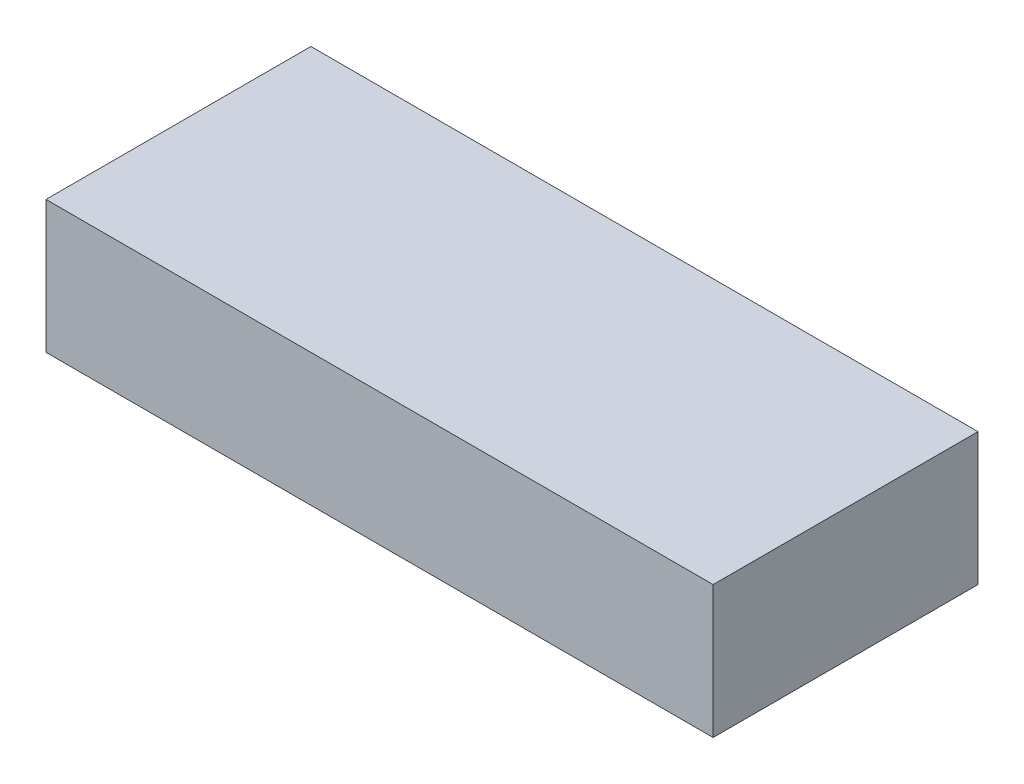
ISO-10303-21;
HEADER;
FILE_DESCRIPTION(('STEP AP214'),'2;1');
FILE_NAME('part.step','',(''),(''),'','','');
FILE_SCHEMA(('AUTOMOTIVE_DESIGN { 1 0 10303 214 1 1 1 1 }'));
ENDSEC;
DATA;
#1=APPLICATION_CONTEXT('core data for automotive mechanical design processes');
#2=APPLICATION_PROTOCOL_DEFINITION('international standard','automotive_design',2000,#1);
#3=PRODUCT_CONTEXT('',#1,'mechanical');
#4=PRODUCT('Part','Part','',(#3));
#5=PRODUCT_RELATED_PRODUCT_CATEGORY('part','',(#4));
#6=PRODUCT_DEFINITION_FORMATION('','',#4);
#7=PRODUCT_DEFINITION_CONTEXT('part definition',#1,'design');
#8=PRODUCT_DEFINITION('design','',#6,#7);
#9=PRODUCT_DEFINITION_SHAPE('','',#8);
#10=(LENGTH_UNIT() NAMED_UNIT(*) SI_UNIT(.MILLI.,.METRE.));
#11=(NAMED_UNIT(*) PLANE_ANGLE_UNIT() SI_UNIT($,.RADIAN.));
#12=(NAMED_UNIT(*) SI_UNIT($,.STERADIAN.) SOLID_ANGLE_UNIT());
#13=UNCERTAINTY_MEASURE_WITH_UNIT(LENGTH_MEASURE(1.E-05),#10,'distance_accuracy_value','');
#14=(GEOMETRIC_REPRESENTATION_CONTEXT(3) GLOBAL_UNCERTAINTY_ASSIGNED_CONTEXT((#13)) GLOBAL_UNIT_ASSIGNED_CONTEXT((#10,
#11,#12)) REPRESENTATION_CONTEXT('',''));
#15=CARTESIAN_POINT('',(0.,0.,0.));
#16=DIRECTION('',(0.,0.,1.));
#17=DIRECTION('',(1.,0.,0.));
#18=AXIS2_PLACEMENT_3D('',#15,#16,#17);
#19=CARTESIAN_POINT('',(215.9,85.725,85.725));
#20=DIRECTION('',(-1.,0.,0.));
#21=DIRECTION('',(0.,0.,1.));
#22=AXIS2_PLACEMENT_3D('',#19,#20,#21);
#23=PLANE('',#22);
#24=DIRECTION('',(0.,0.,-1.));
#25=VECTOR('',#24,1.);
#26=CARTESIAN_POINT('',(215.9,0.,85.725));
#27=LINE('',#26,#25);
#28=CARTESIAN_POINT('',(215.9,0.,85.725));
#29=VERTEX_POINT('',#28);
#30=CARTESIAN_POINT('',(215.9,0.,-85.725));
#31=VERTEX_POINT('',#30);
#32=EDGE_CURVE('E179',#29,#31,#27,.T.);
#33=ORIENTED_EDGE('',*,*,#32,.T.);
#34=DIRECTION('',(0.,-1.,0.));
#35=VECTOR('',#34,1.);
#36=CARTESIAN_POINT('',(215.9,85.725,-85.725));
#37=LINE('',#36,#35);
#38=CARTESIAN_POINT('',(215.9,85.725,-85.725));
#39=VERTEX_POINT('',#38);
#40=EDGE_CURVE('E211',#39,#31,#37,.T.);
#41=ORIENTED_EDGE('',*,*,#40,.F.);
#42=DIRECTION('',(0.,0.,-1.));
#43=VECTOR('',#42,1.);
#44=CARTESIAN_POINT('',(215.9,85.725,85.725));
#45=LINE('',#44,#43);
#46=CARTESIAN_POINT('',(215.9,85.725,85.725));
#47=VERTEX_POINT('',#46);
#48=EDGE_CURVE('E188',#47,#39,#45,.T.);
#49=ORIENTED_EDGE('',*,*,#48,.F.);
#50=DIRECTION('',(0.,-1.,0.));
#51=VECTOR('',#50,1.);
#52=CARTESIAN_POINT('',(215.9,85.725,85.725));
#53=LINE('',#52,#51);
#54=EDGE_CURVE('E197',#47,#29,#53,.T.);
#55=ORIENTED_EDGE('',*,*,#54,.T.);
#56=EDGE_LOOP('',(#33,#41,#49,#55));
#57=FACE_BOUND('',#56,.T.);
#58=ADVANCED_FACE('F41',(#57),#23,.F.);
#59=CARTESIAN_POINT('',(-215.9,85.725,-85.725));
#60=DIRECTION('',(0.,0.,1.));
#61=DIRECTION('',(1.,0.,0.));
#62=AXIS2_PLACEMENT_3D('',#59,#60,#61);
#63=PLANE('',#62);
#64=DIRECTION('',(-1.,0.,0.));
#65=VECTOR('',#64,1.);
#66=CARTESIAN_POINT('',(-215.9,0.,-85.725));
#67=LINE('',#66,#65);
#68=CARTESIAN_POINT('',(-215.9,0.,-85.725));
#69=VERTEX_POINT('',#68);
#70=EDGE_CURVE('E182',#31,#69,#67,.T.);
#71=ORIENTED_EDGE('',*,*,#70,.T.);
#72=DIRECTION('',(0.,-1.,0.));
#73=VECTOR('',#72,1.);
#74=CARTESIAN_POINT('',(-215.9,85.725,-85.725));
#75=LINE('',#74,#73);
#76=CARTESIAN_POINT('',(-215.9,85.725,-85.725));
#77=VERTEX_POINT('',#76);
#78=EDGE_CURVE('E208',#77,#69,#75,.T.);
#79=ORIENTED_EDGE('',*,*,#78,.F.);
#80=DIRECTION('',(-1.,0.,0.));
#81=VECTOR('',#80,1.);
#82=CARTESIAN_POINT('',(-215.9,85.725,-85.725));
#83=LINE('',#82,#81);
#84=EDGE_CURVE('E191',#39,#77,#83,.T.);
#85=ORIENTED_EDGE('',*,*,#84,.F.);
#86=ORIENTED_EDGE('',*,*,#40,.T.);
#87=EDGE_LOOP('',(#71,#79,#85,#86));
#88=FACE_BOUND('',#87,.T.);
#89=ADVANCED_FACE('F346',(#88),#63,.F.);
#90=CARTESIAN_POINT('',(-215.9,85.725,85.725));
#91=DIRECTION('',(1.,0.,0.));
#92=DIRECTION('',(0.,0.,-1.));
#93=AXIS2_PLACEMENT_3D('',#90,#91,#92);
#94=PLANE('',#93);
#95=DIRECTION('',(0.,0.,1.));
#96=VECTOR('',#95,1.);
#97=CARTESIAN_POINT('',(-215.9,0.,85.725));
#98=LINE('',#97,#96);
#99=CARTESIAN_POINT('',(-215.9,0.,85.725));
#100=VERTEX_POINT('',#99);
#101=EDGE_CURVE('E200',#69,#100,#98,.T.);
#102=ORIENTED_EDGE('',*,*,#101,.T.);
#103=DIRECTION('',(0.,-1.,0.));
#104=VECTOR('',#103,1.);
#105=CARTESIAN_POINT('',(-215.9,85.725,85.725));
#106=LINE('',#105,#104);
#107=CARTESIAN_POINT('',(-215.9,85.725,85.725));
#108=VERTEX_POINT('',#107);
#109=EDGE_CURVE('E205',#108,#100,#106,.T.);
#110=ORIENTED_EDGE('',*,*,#109,.F.);
#111=DIRECTION('',(0.,0.,1.));
#112=VECTOR('',#111,1.);
#113=CARTESIAN_POINT('',(-215.9,85.725,85.725));
#114=LINE('',#113,#112);
#115=EDGE_CURVE('E194',#77,#108,#114,.T.);
#116=ORIENTED_EDGE('',*,*,#115,.F.);
#117=ORIENTED_EDGE('',*,*,#78,.T.);
#118=EDGE_LOOP('',(#102,#110,#116,#117));
#119=FACE_BOUND('',#118,.T.);
#120=ADVANCED_FACE('F352',(#119),#94,.F.);
#121=CARTESIAN_POINT('',(-215.9,85.725,85.725));
#122=DIRECTION('',(0.,0.,-1.));
#123=DIRECTION('',(-1.,0.,0.));
#124=AXIS2_PLACEMENT_3D('',#121,#122,#123);
#125=PLANE('',#124);
#126=DIRECTION('',(1.,0.,0.));
#127=VECTOR('',#126,1.);
#128=CARTESIAN_POINT('',(-215.9,0.,85.725));
#129=LINE('',#128,#127);
#130=EDGE_CURVE('E192',#100,#29,#129,.T.);
#131=ORIENTED_EDGE('',*,*,#130,.T.);
#132=ORIENTED_EDGE('',*,*,#54,.F.);
#133=DIRECTION('',(1.,0.,0.));
#134=VECTOR('',#133,1.);
#135=CARTESIAN_POINT('',(-215.9,85.725,85.725));
#136=LINE('',#135,#134);
#137=EDGE_CURVE('E196',#108,#47,#136,.T.);
#138=ORIENTED_EDGE('',*,*,#137,.F.);
#139=ORIENTED_EDGE('',*,*,#109,.T.);
#140=EDGE_LOOP('',(#131,#132,#138,#139));
#141=FACE_BOUND('',#140,.T.);
#142=ADVANCED_FACE('F499',(#141),#125,.F.);
#143=CARTESIAN_POINT('',(0.,85.725,0.));
#144=DIRECTION('',(0.,-1.,0.));
#145=DIRECTION('',(0.,0.,-1.));
#146=AXIS2_PLACEMENT_3D('',#143,#144,#145);
#147=PLANE('',#146);
#148=ORIENTED_EDGE('',*,*,#48,.T.);
#149=ORIENTED_EDGE('',*,*,#84,.T.);
#150=ORIENTED_EDGE('',*,*,#115,.T.);
#151=ORIENTED_EDGE('',*,*,#137,.T.);
#152=EDGE_LOOP('',(#148,#149,#150,#151));
#153=FACE_BOUND('',#152,.T.);
#154=ADVANCED_FACE('F464',(#153),#147,.F.);
#155=CARTESIAN_POINT('',(0.,0.,0.));
#156=DIRECTION('',(0.,-1.,0.));
#157=DIRECTION('',(0.,0.,-1.));
#158=AXIS2_PLACEMENT_3D('',#155,#156,#157);
#159=PLANE('',#158);
#160=DIRECTION('',(0.,0.,-1.));
#161=VECTOR('',#160,1.);
#162=CARTESIAN_POINT('',(202.950394914719,0.,-48.6314169137195));
#163=LINE('',#162,#161);
#164=CARTESIAN_POINT('',(202.950394914719,0.,48.6314169137195));
#165=VERTEX_POINT('',#164);
#166=CARTESIAN_POINT('',(202.950394914719,0.,-48.6314169137195));
#167=VERTEX_POINT('',#166);
#168=EDGE_CURVE('E226',#165,#167,#163,.T.);
#169=ORIENTED_EDGE('',*,*,#168,.T.);
#170=CARTESIAN_POINT('',(178.806416913719,0.,-48.6314169137195));
#171=DIRECTION('',(0.,-1.,0.));
#172=DIRECTION('',(0.,0.,-1.));
#173=AXIS2_PLACEMENT_3D('',#170,#171,#172);
#174=CIRCLE('',#173,24.143978001);
#175=CARTESIAN_POINT('',(178.806416913719,0.,-72.7753949147195));
#176=VERTEX_POINT('',#175);
#177=EDGE_CURVE('E228',#167,#176,#174,.F.);
#178=ORIENTED_EDGE('',*,*,#177,.T.);
#179=DIRECTION('',(-1.,0.,0.));
#180=VECTOR('',#179,1.);
#181=CARTESIAN_POINT('',(-178.806416913719,0.,-72.7753949147195));
#182=LINE('',#181,#180);
#183=CARTESIAN_POINT('',(-178.806416913719,0.,-72.7753949147195));
#184=VERTEX_POINT('',#183);
#185=EDGE_CURVE('E218',#176,#184,#182,.T.);
#186=ORIENTED_EDGE('',*,*,#185,.T.);
#187=CARTESIAN_POINT('',(-178.806416913719,0.,-48.6314169137195));
#188=DIRECTION('',(0.,-1.,0.));
#189=DIRECTION('',(0.,0.,-1.));
#190=AXIS2_PLACEMENT_3D('',#187,#188,#189);
#191=CIRCLE('',#190,24.143978001);
#192=CARTESIAN_POINT('',(-202.950394914719,0.,-48.6314169137195));
#193=VERTEX_POINT('',#192);
#194=EDGE_CURVE('E214',#184,#193,#191,.F.);
#195=ORIENTED_EDGE('',*,*,#194,.T.);
#196=DIRECTION('',(0.,0.,1.));
#197=VECTOR('',#196,1.);
#198=CARTESIAN_POINT('',(-202.950394914719,0.,48.6314169137195));
#199=LINE('',#198,#197);
#200=CARTESIAN_POINT('',(-202.950394914719,0.,48.6314169137195));
#201=VERTEX_POINT('',#200);
#202=EDGE_CURVE('E216',#193,#201,#199,.T.);
#203=ORIENTED_EDGE('',*,*,#202,.T.);
#204=CARTESIAN_POINT('',(-178.806416913719,0.,48.6314169137195));
#205=DIRECTION('',(0.,-1.,0.));
#206=DIRECTION('',(0.,0.,-1.));
#207=AXIS2_PLACEMENT_3D('',#204,#205,#206);
#208=CIRCLE('',#207,24.143978001);
#209=CARTESIAN_POINT('',(-178.806416913719,0.,72.7753949147195));
#210=VERTEX_POINT('',#209);
#211=EDGE_CURVE('E220',#201,#210,#208,.F.);
#212=ORIENTED_EDGE('',*,*,#211,.T.);
#213=DIRECTION('',(1.,0.,0.));
#214=VECTOR('',#213,1.);
#215=CARTESIAN_POINT('',(178.806416913719,0.,72.7753949147195));
#216=LINE('',#215,#214);
#217=CARTESIAN_POINT('',(178.806416913719,0.,72.7753949147195));
#218=VERTEX_POINT('',#217);
#219=EDGE_CURVE('E222',#210,#218,#216,.T.);
#220=ORIENTED_EDGE('',*,*,#219,.T.);
#221=CARTESIAN_POINT('',(178.806416913719,0.,48.6314169137195));
#222=DIRECTION('',(0.,-1.,0.));
#223=DIRECTION('',(0.,0.,-1.));
#224=AXIS2_PLACEMENT_3D('',#221,#222,#223);
#225=CIRCLE('',#224,24.143978001);
#226=EDGE_CURVE('E224',#218,#165,#225,.F.);
#227=ORIENTED_EDGE('',*,*,#226,.T.);
#228=EDGE_LOOP('',(#169,#178,#186,#195,#203,#212,#220,#227));
#229=FACE_BOUND('',#228,.T.);
#230=ORIENTED_EDGE('',*,*,#32,.F.);
#231=ORIENTED_EDGE('',*,*,#130,.F.);
#232=ORIENTED_EDGE('',*,*,#101,.F.);
#233=ORIENTED_EDGE('',*,*,#70,.F.);
#234=EDGE_LOOP('',(#230,#231,#232,#233));
#235=FACE_BOUND('',#234,.T.);
#236=ADVANCED_FACE('F469',(#229,#235),#159,.T.);
#237=CARTESIAN_POINT('',(178.806416913719,515.309709215543,72.1403949147195));
#238=DIRECTION('',(0.,0.,1.));
#239=DIRECTION('',(1.,0.,0.));
#240=AXIS2_PLACEMENT_3D('',#237,#238,#239);
#241=PLANE('',#240);
#242=DIRECTION('',(0.,-1.,0.));
#243=VECTOR('',#242,1.);
#244=CARTESIAN_POINT('',(178.806416913719,515.309709215543,72.1403949147195));
#245=LINE('',#244,#243);
#246=CARTESIAN_POINT('',(178.806416913719,73.025,72.1403949147195));
#247=VERTEX_POINT('',#246);
#248=CARTESIAN_POINT('',(178.806416913719,0.634999999999941,72.1403949147195));
#249=VERTEX_POINT('',#248);
#250=EDGE_CURVE('E164',#247,#249,#245,.T.);
#251=ORIENTED_EDGE('',*,*,#250,.T.);
#252=DIRECTION('',(-1.,0.,0.));
#253=VECTOR('',#252,1.);
#254=CARTESIAN_POINT('',(-178.806416913719,0.634999999999941,72.1403949147195));
#255=LINE('',#254,#253);
#256=CARTESIAN_POINT('',(-178.806416913719,0.634999999999941,72.1403949147195));
#257=VERTEX_POINT('',#256);
#258=EDGE_CURVE('E238',#249,#257,#255,.T.);
#259=ORIENTED_EDGE('',*,*,#258,.T.);
#260=DIRECTION('',(0.,-1.,0.));
#261=VECTOR('',#260,1.);
#262=CARTESIAN_POINT('',(-178.806416913719,515.309709215543,72.1403949147195));
#263=LINE('',#262,#261);
#264=CARTESIAN_POINT('',(-178.806416913719,73.025,72.1403949147195));
#265=VERTEX_POINT('',#264);
#266=EDGE_CURVE('E173',#265,#257,#263,.T.);
#267=ORIENTED_EDGE('',*,*,#266,.F.);
#268=DIRECTION('',(1.,0.,0.));
#269=VECTOR('',#268,1.);
#270=CARTESIAN_POINT('',(178.806416913719,73.025,72.1403949147195));
#271=LINE('',#270,#269);
#272=EDGE_CURVE('E177',#265,#247,#271,.T.);
#273=ORIENTED_EDGE('',*,*,#272,.T.);
#274=EDGE_LOOP('',(#251,#259,#267,#273));
#275=FACE_BOUND('',#274,.T.);
#276=ADVANCED_FACE('F324',(#275),#241,.F.);
#277=CARTESIAN_POINT('',(178.806416913719,515.309709215543,48.6314169137195));
#278=DIRECTION('',(0.,-1.,0.));
#279=DIRECTION('',(0.,0.,-1.));
#280=AXIS2_PLACEMENT_3D('',#277,#278,#279);
#281=CYLINDRICAL_SURFACE('',#280,23.508978001);
#282=DIRECTION('',(0.,-1.,0.));
#283=VECTOR('',#282,1.);
#284=CARTESIAN_POINT('',(202.315394914719,515.309709215543,48.6314169137195));
#285=LINE('',#284,#283);
#286=CARTESIAN_POINT('',(202.315394914719,73.025,48.6314169137195));
#287=VERTEX_POINT('',#286);
#288=CARTESIAN_POINT('',(202.315394914719,0.634999999999941,48.6314169137195));
#289=VERTEX_POINT('',#288);
#290=EDGE_CURVE('E311',#287,#289,#285,.T.);
#291=ORIENTED_EDGE('',*,*,#290,.T.);
#292=CARTESIAN_POINT('',(178.806416913719,0.634999999999941,48.6314169137195));
#293=DIRECTION('',(0.,-1.,0.));
#294=DIRECTION('',(0.,0.,-1.));
#295=AXIS2_PLACEMENT_3D('',#292,#293,#294);
#296=CIRCLE('',#295,23.508978001);
#297=EDGE_CURVE('E236',#289,#249,#296,.T.);
#298=ORIENTED_EDGE('',*,*,#297,.T.);
#299=ORIENTED_EDGE('',*,*,#250,.F.);
#300=CARTESIAN_POINT('',(178.806416913719,73.025,48.6314169137195));
#301=DIRECTION('',(0.,-1.,0.));
#302=DIRECTION('',(0.,0.,-1.));
#303=AXIS2_PLACEMENT_3D('',#300,#301,#302);
#304=CIRCLE('',#303,23.508978001);
#305=EDGE_CURVE('E184',#287,#247,#304,.T.);
#306=ORIENTED_EDGE('',*,*,#305,.F.);
#307=EDGE_LOOP('',(#291,#298,#299,#306));
#308=FACE_BOUND('',#307,.T.);
#309=ADVANCED_FACE('F314',(#308),#281,.F.);
#310=CARTESIAN_POINT('',(202.315394914719,515.309709215543,-48.6314169137195));
#311=DIRECTION('',(1.,0.,0.));
#312=DIRECTION('',(0.,0.,-1.));
#313=AXIS2_PLACEMENT_3D('',#310,#311,#312);
#314=PLANE('',#313);
#315=DIRECTION('',(0.,-1.,0.));
#316=VECTOR('',#315,1.);
#317=CARTESIAN_POINT('',(202.315394914719,515.309709215543,-48.6314169137195));
#318=LINE('',#317,#316);
#319=CARTESIAN_POINT('',(202.315394914719,73.025,-48.6314169137195));
#320=VERTEX_POINT('',#319);
#321=CARTESIAN_POINT('',(202.315394914719,0.634999999999941,-48.6314169137195));
#322=VERTEX_POINT('',#321);
#323=EDGE_CURVE('E296',#320,#322,#318,.T.);
#324=ORIENTED_EDGE('',*,*,#323,.T.);
#325=DIRECTION('',(0.,0.,1.));
#326=VECTOR('',#325,1.);
#327=CARTESIAN_POINT('',(202.315394914719,0.634999999999941,48.6314169137195));
#328=LINE('',#327,#326);
#329=EDGE_CURVE('E234',#322,#289,#328,.T.);
#330=ORIENTED_EDGE('',*,*,#329,.T.);
#331=ORIENTED_EDGE('',*,*,#290,.F.);
#332=DIRECTION('',(0.,0.,-1.));
#333=VECTOR('',#332,1.);
#334=CARTESIAN_POINT('',(202.315394914719,73.025,-48.6314169137195));
#335=LINE('',#334,#333);
#336=EDGE_CURVE('E336',#287,#320,#335,.T.);
#337=ORIENTED_EDGE('',*,*,#336,.T.);
#338=EDGE_LOOP('',(#324,#330,#331,#337));
#339=FACE_BOUND('',#338,.T.);
#340=ADVANCED_FACE('F310',(#339),#314,.F.);
#341=CARTESIAN_POINT('',(178.806416913719,515.309709215543,-48.6314169137195));
#342=DIRECTION('',(0.,-1.,0.));
#343=DIRECTION('',(0.,0.,-1.));
#344=AXIS2_PLACEMENT_3D('',#341,#342,#343);
#345=CYLINDRICAL_SURFACE('',#344,23.508978001);
#346=DIRECTION('',(0.,-1.,0.));
#347=VECTOR('',#346,1.);
#348=CARTESIAN_POINT('',(178.806416913719,515.309709215543,-72.1403949147196));
#349=LINE('',#348,#347);
#350=CARTESIAN_POINT('',(178.806416913719,73.025,-72.1403949147195));
#351=VERTEX_POINT('',#350);
#352=CARTESIAN_POINT('',(178.806416913719,0.634999999999941,-72.1403949147196));
#353=VERTEX_POINT('',#352);
#354=EDGE_CURVE('E286',#351,#353,#349,.T.);
#355=ORIENTED_EDGE('',*,*,#354,.T.);
#356=CARTESIAN_POINT('',(178.806416913719,0.634999999999941,-48.6314169137195));
#357=DIRECTION('',(0.,-1.,0.));
#358=DIRECTION('',(0.,0.,-1.));
#359=AXIS2_PLACEMENT_3D('',#356,#357,#358);
#360=CIRCLE('',#359,23.508978001);
#361=EDGE_CURVE('E231',#353,#322,#360,.T.);
#362=ORIENTED_EDGE('',*,*,#361,.T.);
#363=ORIENTED_EDGE('',*,*,#323,.F.);
#364=CARTESIAN_POINT('',(178.806416913719,73.025,-48.6314169137195));
#365=DIRECTION('',(0.,-1.,0.));
#366=DIRECTION('',(0.,0.,-1.));
#367=AXIS2_PLACEMENT_3D('',#364,#365,#366);
#368=CIRCLE('',#367,23.508978001);
#369=EDGE_CURVE('E294',#351,#320,#368,.T.);
#370=ORIENTED_EDGE('',*,*,#369,.F.);
#371=EDGE_LOOP('',(#355,#362,#363,#370));
#372=FACE_BOUND('',#371,.T.);
#373=ADVANCED_FACE('F290',(#372),#345,.F.);
#374=CARTESIAN_POINT('',(-178.806416913719,515.309709215543,-72.1403949147195));
#375=DIRECTION('',(0.,0.,-1.));
#376=DIRECTION('',(-1.,0.,0.));
#377=AXIS2_PLACEMENT_3D('',#374,#375,#376);
#378=PLANE('',#377);
#379=DIRECTION('',(0.,-1.,0.));
#380=VECTOR('',#379,1.);
#381=CARTESIAN_POINT('',(-178.806416913719,515.309709215543,-72.1403949147195));
#382=LINE('',#381,#380);
#383=CARTESIAN_POINT('',(-178.806416913719,73.025,-72.1403949147196));
#384=VERTEX_POINT('',#383);
#385=CARTESIAN_POINT('',(-178.806416913719,0.634999999999941,-72.1403949147195));
#386=VERTEX_POINT('',#385);
#387=EDGE_CURVE('E287',#384,#386,#382,.T.);
#388=ORIENTED_EDGE('',*,*,#387,.T.);
#389=DIRECTION('',(1.,0.,0.));
#390=VECTOR('',#389,1.);
#391=CARTESIAN_POINT('',(178.806416913719,0.634999999999941,-72.1403949147195));
#392=LINE('',#391,#390);
#393=EDGE_CURVE('E241',#386,#353,#392,.T.);
#394=ORIENTED_EDGE('',*,*,#393,.T.);
#395=ORIENTED_EDGE('',*,*,#354,.F.);
#396=DIRECTION('',(-1.,0.,0.));
#397=VECTOR('',#396,1.);
#398=CARTESIAN_POINT('',(-178.806416913719,73.025,-72.1403949147195));
#399=LINE('',#398,#397);
#400=EDGE_CURVE('E331',#351,#384,#399,.T.);
#401=ORIENTED_EDGE('',*,*,#400,.T.);
#402=EDGE_LOOP('',(#388,#394,#395,#401));
#403=FACE_BOUND('',#402,.T.);
#404=ADVANCED_FACE('F285',(#403),#378,.F.);
#405=CARTESIAN_POINT('',(-178.806416913719,515.309709215543,-48.6314169137195));
#406=DIRECTION('',(0.,-1.,0.));
#407=DIRECTION('',(0.,0.,-1.));
#408=AXIS2_PLACEMENT_3D('',#405,#406,#407);
#409=CYLINDRICAL_SURFACE('',#408,23.508978001);
#410=DIRECTION('',(0.,-1.,0.));
#411=VECTOR('',#410,1.);
#412=CARTESIAN_POINT('',(-202.315394914719,515.309709215543,-48.6314169137195));
#413=LINE('',#412,#411);
#414=CARTESIAN_POINT('',(-202.315394914719,73.025,-48.6314169137195));
#415=VERTEX_POINT('',#414);
#416=CARTESIAN_POINT('',(-202.315394914719,0.634999999999941,-48.6314169137195));
#417=VERTEX_POINT('',#416);
#418=EDGE_CURVE('E159',#415,#417,#413,.T.);
#419=ORIENTED_EDGE('',*,*,#418,.T.);
#420=CARTESIAN_POINT('',(-178.806416913719,0.634999999999941,-48.6314169137195));
#421=DIRECTION('',(0.,-1.,0.));
#422=DIRECTION('',(0.,0.,-1.));
#423=AXIS2_PLACEMENT_3D('',#420,#421,#422);
#424=CIRCLE('',#423,23.508978001);
#425=EDGE_CURVE('E12',#417,#386,#424,.T.);
#426=ORIENTED_EDGE('',*,*,#425,.T.);
#427=ORIENTED_EDGE('',*,*,#387,.F.);
#428=CARTESIAN_POINT('',(-178.806416913719,73.025,-48.6314169137195));
#429=DIRECTION('',(0.,-1.,0.));
#430=DIRECTION('',(0.,0.,-1.));
#431=AXIS2_PLACEMENT_3D('',#428,#429,#430);
#432=CIRCLE('',#431,23.508978001);
#433=EDGE_CURVE('E163',#415,#384,#432,.T.);
#434=ORIENTED_EDGE('',*,*,#433,.F.);
#435=EDGE_LOOP('',(#419,#426,#427,#434));
#436=FACE_BOUND('',#435,.T.);
#437=ADVANCED_FACE('F330',(#436),#409,.F.);
#438=CARTESIAN_POINT('',(-202.315394914719,515.309709215543,48.6314169137195));
#439=DIRECTION('',(-1.,0.,0.));
#440=DIRECTION('',(0.,0.,1.));
#441=AXIS2_PLACEMENT_3D('',#438,#439,#440);
#442=PLANE('',#441);
#443=DIRECTION('',(0.,-1.,0.));
#444=VECTOR('',#443,1.);
#445=CARTESIAN_POINT('',(-202.315394914719,515.309709215543,48.6314169137195));
#446=LINE('',#445,#444);
#447=CARTESIAN_POINT('',(-202.315394914719,73.025,48.6314169137195));
#448=VERTEX_POINT('',#447);
#449=CARTESIAN_POINT('',(-202.315394914719,0.634999999999941,48.6314169137195));
#450=VERTEX_POINT('',#449);
#451=EDGE_CURVE('E157',#448,#450,#446,.T.);
#452=ORIENTED_EDGE('',*,*,#451,.T.);
#453=DIRECTION('',(0.,0.,-1.));
#454=VECTOR('',#453,1.);
#455=CARTESIAN_POINT('',(-202.315394914719,0.634999999999941,-48.6314169137195));
#456=LINE('',#455,#454);
#457=EDGE_CURVE('E50',#450,#417,#456,.T.);
#458=ORIENTED_EDGE('',*,*,#457,.T.);
#459=ORIENTED_EDGE('',*,*,#418,.F.);
#460=DIRECTION('',(0.,0.,1.));
#461=VECTOR('',#460,1.);
#462=CARTESIAN_POINT('',(-202.315394914719,73.025,48.6314169137195));
#463=LINE('',#462,#461);
#464=EDGE_CURVE('E154',#415,#448,#463,.T.);
#465=ORIENTED_EDGE('',*,*,#464,.T.);
#466=EDGE_LOOP('',(#452,#458,#459,#465));
#467=FACE_BOUND('',#466,.T.);
#468=ADVANCED_FACE('F156',(#467),#442,.F.);
#469=CARTESIAN_POINT('',(-178.806416913719,515.309709215543,48.6314169137195));
#470=DIRECTION('',(0.,-1.,0.));
#471=DIRECTION('',(0.,0.,-1.));
#472=AXIS2_PLACEMENT_3D('',#469,#470,#471);
#473=CYLINDRICAL_SURFACE('',#472,23.508978001);
#474=ORIENTED_EDGE('',*,*,#266,.T.);
#475=CARTESIAN_POINT('',(-178.806416913719,0.634999999999941,48.6314169137195));
#476=DIRECTION('',(0.,-1.,0.));
#477=DIRECTION('',(0.,0.,-1.));
#478=AXIS2_PLACEMENT_3D('',#475,#476,#477);
#479=CIRCLE('',#478,23.508978001);
#480=EDGE_CURVE('E172',#257,#450,#479,.T.);
#481=ORIENTED_EDGE('',*,*,#480,.T.);
#482=ORIENTED_EDGE('',*,*,#451,.F.);
#483=CARTESIAN_POINT('',(-178.806416913719,73.025,48.6314169137195));
#484=DIRECTION('',(0.,-1.,0.));
#485=DIRECTION('',(0.,0.,-1.));
#486=AXIS2_PLACEMENT_3D('',#483,#484,#485);
#487=CIRCLE('',#486,23.508978001);
#488=EDGE_CURVE('E169',#448,#265,#487,.F.);
#489=ORIENTED_EDGE('',*,*,#488,.T.);
#490=EDGE_LOOP('',(#474,#481,#482,#489));
#491=FACE_BOUND('',#490,.T.);
#492=ADVANCED_FACE('F168',(#491),#473,.F.);
#493=CARTESIAN_POINT('',(0.,73.025,0.));
#494=DIRECTION('',(0.,-1.,0.));
#495=DIRECTION('',(0.,0.,-1.));
#496=AXIS2_PLACEMENT_3D('',#493,#494,#495);
#497=PLANE('',#496);
#498=ORIENTED_EDGE('',*,*,#272,.F.);
#499=ORIENTED_EDGE('',*,*,#488,.F.);
#500=ORIENTED_EDGE('',*,*,#464,.F.);
#501=ORIENTED_EDGE('',*,*,#433,.T.);
#502=ORIENTED_EDGE('',*,*,#400,.F.);
#503=ORIENTED_EDGE('',*,*,#369,.T.);
#504=ORIENTED_EDGE('',*,*,#336,.F.);
#505=ORIENTED_EDGE('',*,*,#305,.T.);
#506=EDGE_LOOP('',(#498,#499,#500,#501,#502,#503,#504,#505));
#507=FACE_BOUND('',#506,.T.);
#508=ADVANCED_FACE('F175',(#507),#497,.T.);
#509=CARTESIAN_POINT('',(-178.806416913719,0.634999999999941,48.6314169137195));
#510=DIRECTION('',(0.,-1.,0.));
#511=DIRECTION('',(0.,0.,-1.));
#512=AXIS2_PLACEMENT_3D('',#509,#510,#511);
#513=CONICAL_SURFACE('',#512,23.508978001,0.785398163397476);
#514=DIRECTION('',(-0.707106781186563,-0.707106781186532,0.));
#515=VECTOR('',#514,1.);
#516=CARTESIAN_POINT('',(-202.315394914719,0.634999999999941,48.6314169137195));
#517=LINE('',#516,#515);
#518=EDGE_CURVE('E259',#450,#201,#517,.T.);
#519=ORIENTED_EDGE('',*,*,#518,.F.);
#520=ORIENTED_EDGE('',*,*,#480,.F.);
#521=DIRECTION('',(0.,0.707106781186524,-0.707106781186571));
#522=VECTOR('',#521,1.);
#523=CARTESIAN_POINT('',(-178.806416913719,0.,72.7753949147195));
#524=LINE('',#523,#522);
#525=EDGE_CURVE('E45',#210,#257,#524,.T.);
#526=ORIENTED_EDGE('',*,*,#525,.F.);
#527=ORIENTED_EDGE('',*,*,#211,.F.);
#528=EDGE_LOOP('',(#519,#520,#526,#527));
#529=FACE_BOUND('',#528,.T.);
#530=ADVANCED_FACE('F43',(#529),#513,.F.);
#531=CARTESIAN_POINT('',(178.806416913719,0.634999999999941,72.1403949147195));
#532=DIRECTION('',(0.,-0.707106781186571,-0.707106781186524));
#533=DIRECTION('',(1.,0.,0.));
#534=AXIS2_PLACEMENT_3D('',#531,#532,#533);
#535=PLANE('',#534);
#536=ORIENTED_EDGE('',*,*,#525,.T.);
#537=ORIENTED_EDGE('',*,*,#258,.F.);
#538=DIRECTION('',(0.,0.707106781186524,-0.707106781186571));
#539=VECTOR('',#538,1.);
#540=CARTESIAN_POINT('',(178.806416913719,0.,72.7753949147195));
#541=LINE('',#540,#539);
#542=EDGE_CURVE('E257',#218,#249,#541,.T.);
#543=ORIENTED_EDGE('',*,*,#542,.F.);
#544=ORIENTED_EDGE('',*,*,#219,.F.);
#545=EDGE_LOOP('',(#536,#537,#543,#544));
#546=FACE_BOUND('',#545,.T.);
#547=ADVANCED_FACE('F323',(#546),#535,.T.);
#548=CARTESIAN_POINT('',(-202.315394914719,0.634999999999941,48.6314169137195));
#549=DIRECTION('',(0.707106781186532,-0.707106781186563,0.));
#550=DIRECTION('',(0.,0.,1.));
#551=AXIS2_PLACEMENT_3D('',#548,#549,#550);
#552=PLANE('',#551);
#553=ORIENTED_EDGE('',*,*,#518,.T.);
#554=ORIENTED_EDGE('',*,*,#202,.F.);
#555=DIRECTION('',(-0.707106781186563,-0.707106781186532,0.));
#556=VECTOR('',#555,1.);
#557=CARTESIAN_POINT('',(-202.315394914719,0.634999999999941,-48.6314169137195));
#558=LINE('',#557,#556);
#559=EDGE_CURVE('E254',#417,#193,#558,.T.);
#560=ORIENTED_EDGE('',*,*,#559,.F.);
#561=ORIENTED_EDGE('',*,*,#457,.F.);
#562=EDGE_LOOP('',(#553,#554,#560,#561));
#563=FACE_BOUND('',#562,.T.);
#564=ADVANCED_FACE('F272',(#563),#552,.T.);
#565=CARTESIAN_POINT('',(178.806416913719,0.,48.6314169137195));
#566=DIRECTION('',(0.,-1.,0.));
#567=DIRECTION('',(0.,0.,-1.));
#568=AXIS2_PLACEMENT_3D('',#565,#566,#567);
#569=CONICAL_SURFACE('',#568,24.143978001,0.785398163397476);
#570=ORIENTED_EDGE('',*,*,#542,.T.);
#571=ORIENTED_EDGE('',*,*,#297,.F.);
#572=DIRECTION('',(-0.707106781186563,0.707106781186532,0.));
#573=VECTOR('',#572,1.);
#574=CARTESIAN_POINT('',(202.950394914719,0.,48.6314169137195));
#575=LINE('',#574,#573);
#576=EDGE_CURVE('E251',#165,#289,#575,.T.);
#577=ORIENTED_EDGE('',*,*,#576,.F.);
#578=ORIENTED_EDGE('',*,*,#226,.F.);
#579=EDGE_LOOP('',(#570,#571,#577,#578));
#580=FACE_BOUND('',#579,.T.);
#581=ADVANCED_FACE('F320',(#580),#569,.F.);
#582=CARTESIAN_POINT('',(-178.806416913719,0.,-48.6314169137195));
#583=DIRECTION('',(0.,-1.,0.));
#584=DIRECTION('',(0.,0.,-1.));
#585=AXIS2_PLACEMENT_3D('',#582,#583,#584);
#586=CONICAL_SURFACE('',#585,24.143978001,0.785398163397476);
#587=ORIENTED_EDGE('',*,*,#559,.T.);
#588=ORIENTED_EDGE('',*,*,#194,.F.);
#589=DIRECTION('',(0.,-0.707106781186524,-0.707106781186571));
#590=VECTOR('',#589,1.);
#591=CARTESIAN_POINT('',(-178.806416913719,0.634999999999941,-72.1403949147195));
#592=LINE('',#591,#590);
#593=EDGE_CURVE('E248',#386,#184,#592,.T.);
#594=ORIENTED_EDGE('',*,*,#593,.F.);
#595=ORIENTED_EDGE('',*,*,#425,.F.);
#596=EDGE_LOOP('',(#587,#588,#594,#595));
#597=FACE_BOUND('',#596,.T.);
#598=ADVANCED_FACE('F276',(#597),#586,.F.);
#599=CARTESIAN_POINT('',(202.315394914719,0.634999999999941,-48.6314169137195));
#600=DIRECTION('',(-0.707106781186532,-0.707106781186563,0.));
#601=DIRECTION('',(0.,0.,-1.));
#602=AXIS2_PLACEMENT_3D('',#599,#600,#601);
#603=PLANE('',#602);
#604=ORIENTED_EDGE('',*,*,#576,.T.);
#605=ORIENTED_EDGE('',*,*,#329,.F.);
#606=DIRECTION('',(-0.707106781186563,0.707106781186532,0.));
#607=VECTOR('',#606,1.);
#608=CARTESIAN_POINT('',(202.950394914719,0.,-48.6314169137195));
#609=LINE('',#608,#607);
#610=EDGE_CURVE('E246',#167,#322,#609,.T.);
#611=ORIENTED_EDGE('',*,*,#610,.F.);
#612=ORIENTED_EDGE('',*,*,#168,.F.);
#613=EDGE_LOOP('',(#604,#605,#611,#612));
#614=FACE_BOUND('',#613,.T.);
#615=ADVANCED_FACE('F305',(#614),#603,.T.);
#616=CARTESIAN_POINT('',(-178.806416913719,0.634999999999941,-72.1403949147195));
#617=DIRECTION('',(0.,-0.707106781186571,0.707106781186524));
#618=DIRECTION('',(-1.,0.,0.));
#619=AXIS2_PLACEMENT_3D('',#616,#617,#618);
#620=PLANE('',#619);
#621=ORIENTED_EDGE('',*,*,#593,.T.);
#622=ORIENTED_EDGE('',*,*,#185,.F.);
#623=DIRECTION('',(0.,-0.707106781186524,-0.707106781186571));
#624=VECTOR('',#623,1.);
#625=CARTESIAN_POINT('',(178.806416913719,0.634999999999941,-72.1403949147195));
#626=LINE('',#625,#624);
#627=EDGE_CURVE('E244',#353,#176,#626,.T.);
#628=ORIENTED_EDGE('',*,*,#627,.F.);
#629=ORIENTED_EDGE('',*,*,#393,.F.);
#630=EDGE_LOOP('',(#621,#622,#628,#629));
#631=FACE_BOUND('',#630,.T.);
#632=ADVANCED_FACE('F281',(#631),#620,.T.);
#633=CARTESIAN_POINT('',(178.806416913719,0.,-48.6314169137195));
#634=DIRECTION('',(0.,-1.,0.));
#635=DIRECTION('',(0.,0.,-1.));
#636=AXIS2_PLACEMENT_3D('',#633,#634,#635);
#637=CONICAL_SURFACE('',#636,24.143978001,0.785398163397476);
#638=ORIENTED_EDGE('',*,*,#610,.T.);
#639=ORIENTED_EDGE('',*,*,#361,.F.);
#640=ORIENTED_EDGE('',*,*,#627,.T.);
#641=ORIENTED_EDGE('',*,*,#177,.F.);
#642=EDGE_LOOP('',(#638,#639,#640,#641));
#643=FACE_BOUND('',#642,.T.);
#644=ADVANCED_FACE('F299',(#643),#637,.F.);
#645=CLOSED_SHELL('',(#58,#89,#120,#142,#154,#236,#276,#309,#340,#373,#404,#437,#468,#492,#508,
#530,#547,#564,#581,#598,#615,#632,#644));
#646=MANIFOLD_SOLID_BREP('B2',#645);
#647=ADVANCED_BREP_SHAPE_REPRESENTATION('',(#18,#646),#14);
#648=SHAPE_DEFINITION_REPRESENTATION(#9,#647);
ENDSEC;
END-ISO-10303-21;
